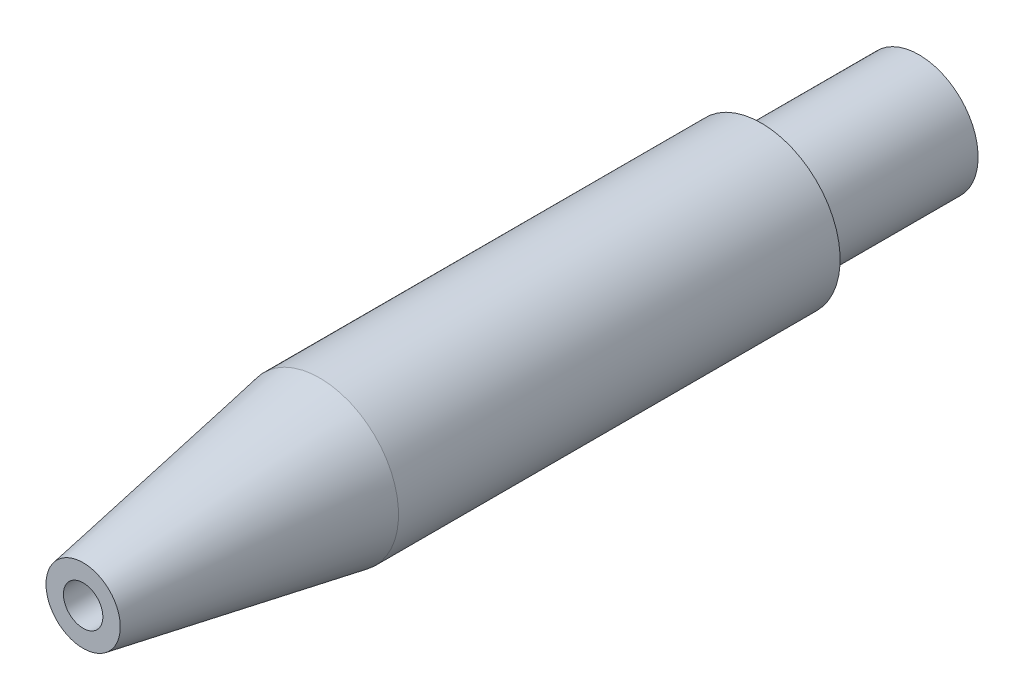
ISO-10303-21;
HEADER;
FILE_DESCRIPTION(('STEP AP214'),'2;1');
FILE_NAME('part.step','',(''),(''),'','','');
FILE_SCHEMA(('AUTOMOTIVE_DESIGN { 1 0 10303 214 1 1 1 1 }'));
ENDSEC;
DATA;
#1=APPLICATION_CONTEXT('core data for automotive mechanical design processes');
#2=APPLICATION_PROTOCOL_DEFINITION('international standard','automotive_design',2000,#1);
#3=PRODUCT_CONTEXT('',#1,'mechanical');
#4=PRODUCT('Part','Part','',(#3));
#5=PRODUCT_RELATED_PRODUCT_CATEGORY('part','',(#4));
#6=PRODUCT_DEFINITION_FORMATION('','',#4);
#7=PRODUCT_DEFINITION_CONTEXT('part definition',#1,'design');
#8=PRODUCT_DEFINITION('design','',#6,#7);
#9=PRODUCT_DEFINITION_SHAPE('','',#8);
#10=(LENGTH_UNIT() NAMED_UNIT(*) SI_UNIT(.MILLI.,.METRE.));
#11=(NAMED_UNIT(*) PLANE_ANGLE_UNIT() SI_UNIT($,.RADIAN.));
#12=(NAMED_UNIT(*) SI_UNIT($,.STERADIAN.) SOLID_ANGLE_UNIT());
#13=UNCERTAINTY_MEASURE_WITH_UNIT(LENGTH_MEASURE(1.E-05),#10,'distance_accuracy_value','');
#14=(GEOMETRIC_REPRESENTATION_CONTEXT(3) GLOBAL_UNCERTAINTY_ASSIGNED_CONTEXT((#13)) GLOBAL_UNIT_ASSIGNED_CONTEXT((#10,
#11,#12)) REPRESENTATION_CONTEXT('',''));
#15=CARTESIAN_POINT('',(0.,0.,0.));
#16=DIRECTION('',(0.,0.,1.));
#17=DIRECTION('',(1.,0.,0.));
#18=AXIS2_PLACEMENT_3D('',#15,#16,#17);
#19=CARTESIAN_POINT('',(0.,0.,67.31));
#20=DIRECTION('',(0.,0.,-1.));
#21=DIRECTION('',(-1.,0.,0.));
#22=AXIS2_PLACEMENT_3D('',#19,#20,#21);
#23=CYLINDRICAL_SURFACE('',#22,6.35);
#24=CARTESIAN_POINT('',(0.,0.,48.26));
#25=DIRECTION('',(0.,0.,-1.));
#26=DIRECTION('',(-1.,0.,0.));
#27=AXIS2_PLACEMENT_3D('',#24,#25,#26);
#28=CIRCLE('',#27,6.35);
#29=CARTESIAN_POINT('',(-6.35,0.,48.26));
#30=VERTEX_POINT('',#29);
#31=EDGE_CURVE('E56',#30,#30,#28,.T.);
#32=ORIENTED_EDGE('',*,*,#31,.T.);
#33=EDGE_LOOP('',(#32));
#34=FACE_BOUND('',#33,.T.);
#35=CARTESIAN_POINT('',(0.,0.,12.7));
#36=DIRECTION('',(0.,0.,-1.));
#37=DIRECTION('',(-1.,0.,0.));
#38=AXIS2_PLACEMENT_3D('',#35,#36,#37);
#39=CIRCLE('',#38,6.35);
#40=CARTESIAN_POINT('',(-6.35,0.,12.7));
#41=VERTEX_POINT('',#40);
#42=EDGE_CURVE('E65',#41,#41,#39,.T.);
#43=ORIENTED_EDGE('',*,*,#42,.F.);
#44=EDGE_LOOP('',(#43));
#45=FACE_BOUND('',#44,.T.);
#46=ADVANCED_FACE('F49',(#34,#45),#23,.T.);
#47=CARTESIAN_POINT('',(0.,0.,0.));
#48=DIRECTION('',(0.,0.,1.));
#49=DIRECTION('',(1.,0.,0.));
#50=AXIS2_PLACEMENT_3D('',#47,#48,#49);
#51=PLANE('',#50);
#52=CARTESIAN_POINT('',(0.,0.,0.));
#53=DIRECTION('',(0.,0.,-1.));
#54=DIRECTION('',(-1.,0.,0.));
#55=AXIS2_PLACEMENT_3D('',#52,#53,#54);
#56=CIRCLE('',#55,3.26389999999999);
#57=CARTESIAN_POINT('',(-3.26389999999999,0.,0.));
#58=VERTEX_POINT('',#57);
#59=EDGE_CURVE('E77',#58,#58,#56,.T.);
#60=ORIENTED_EDGE('',*,*,#59,.F.);
#61=EDGE_LOOP('',(#60));
#62=FACE_BOUND('',#61,.T.);
#63=CARTESIAN_POINT('',(0.,0.,0.));
#64=DIRECTION('',(0.,0.,-1.));
#65=DIRECTION('',(-1.,0.,0.));
#66=AXIS2_PLACEMENT_3D('',#63,#64,#65);
#67=CIRCLE('',#66,4.7625);
#68=CARTESIAN_POINT('',(-4.7625,0.,0.));
#69=VERTEX_POINT('',#68);
#70=EDGE_CURVE('E69',#69,#69,#67,.T.);
#71=ORIENTED_EDGE('',*,*,#70,.T.);
#72=EDGE_LOOP('',(#71));
#73=FACE_BOUND('',#72,.T.);
#74=ADVANCED_FACE('F83',(#62,#73),#51,.F.);
#75=CARTESIAN_POINT('',(0.,0.,48.26));
#76=DIRECTION('',(0.,0.,-1.));
#77=DIRECTION('',(-1.,0.,0.));
#78=AXIS2_PLACEMENT_3D('',#75,#76,#77);
#79=CONICAL_SURFACE('',#78,6.35,0.174532925199434);
#80=CARTESIAN_POINT('',(0.,0.,67.31));
#81=DIRECTION('',(0.,0.,-1.));
#82=DIRECTION('',(-1.,0.,0.));
#83=AXIS2_PLACEMENT_3D('',#80,#81,#82);
#84=CIRCLE('',#83,2.99097101750373);
#85=CARTESIAN_POINT('',(-2.99097101750373,0.,67.31));
#86=VERTEX_POINT('',#85);
#87=EDGE_CURVE('E12',#86,#86,#84,.T.);
#88=ORIENTED_EDGE('',*,*,#87,.T.);
#89=EDGE_LOOP('',(#88));
#90=FACE_BOUND('',#89,.T.);
#91=ORIENTED_EDGE('',*,*,#31,.F.);
#92=EDGE_LOOP('',(#91));
#93=FACE_BOUND('',#92,.T.);
#94=ADVANCED_FACE('F86',(#90,#93),#79,.T.);
#95=CARTESIAN_POINT('',(0.,0.,67.31));
#96=DIRECTION('',(0.,0.,1.));
#97=DIRECTION('',(1.,0.,0.));
#98=AXIS2_PLACEMENT_3D('',#95,#96,#97);
#99=PLANE('',#98);
#100=CARTESIAN_POINT('',(0.,0.,67.31));
#101=DIRECTION('',(0.,0.,1.));
#102=DIRECTION('',(1.,0.,0.));
#103=AXIS2_PLACEMENT_3D('',#100,#101,#102);
#104=CIRCLE('',#103,1.5875);
#105=CARTESIAN_POINT('',(1.5875,0.,67.31));
#106=VERTEX_POINT('',#105);
#107=EDGE_CURVE('E60',#106,#106,#104,.T.);
#108=ORIENTED_EDGE('',*,*,#107,.F.);
#109=EDGE_LOOP('',(#108));
#110=FACE_BOUND('',#109,.T.);
#111=ORIENTED_EDGE('',*,*,#87,.F.);
#112=EDGE_LOOP('',(#111));
#113=FACE_BOUND('',#112,.T.);
#114=ADVANCED_FACE('F114',(#110,#113),#99,.T.);
#115=CARTESIAN_POINT('',(0.,0.,0.));
#116=DIRECTION('',(0.,0.,1.));
#117=DIRECTION('',(1.,0.,0.));
#118=AXIS2_PLACEMENT_3D('',#115,#116,#117);
#119=CYLINDRICAL_SURFACE('',#118,1.5875);
#120=CARTESIAN_POINT('',(0.,0.,60.6972827417378));
#121=DIRECTION('',(0.,0.,-1.));
#122=DIRECTION('',(-1.,0.,0.));
#123=AXIS2_PLACEMENT_3D('',#120,#121,#122);
#124=CIRCLE('',#123,1.5875);
#125=CARTESIAN_POINT('',(-1.5875,0.,60.6972827417378));
#126=VERTEX_POINT('',#125);
#127=EDGE_CURVE('E52',#126,#126,#124,.T.);
#128=ORIENTED_EDGE('',*,*,#127,.T.);
#129=EDGE_LOOP('',(#128));
#130=FACE_BOUND('',#129,.T.);
#131=ORIENTED_EDGE('',*,*,#107,.T.);
#132=EDGE_LOOP('',(#131));
#133=FACE_BOUND('',#132,.T.);
#134=ADVANCED_FACE('F101',(#130,#133),#119,.F.);
#135=CARTESIAN_POINT('',(0.,0.,12.7));
#136=DIRECTION('',(0.,0.,-1.));
#137=DIRECTION('',(-1.,0.,0.));
#138=AXIS2_PLACEMENT_3D('',#135,#136,#137);
#139=PLANE('',#138);
#140=CARTESIAN_POINT('',(0.,0.,12.7));
#141=DIRECTION('',(0.,0.,-1.));
#142=DIRECTION('',(-1.,0.,0.));
#143=AXIS2_PLACEMENT_3D('',#140,#141,#142);
#144=CIRCLE('',#143,4.7625);
#145=CARTESIAN_POINT('',(-4.7625,0.,12.7));
#146=VERTEX_POINT('',#145);
#147=EDGE_CURVE('E68',#146,#146,#144,.T.);
#148=ORIENTED_EDGE('',*,*,#147,.F.);
#149=EDGE_LOOP('',(#148));
#150=FACE_BOUND('',#149,.T.);
#151=ORIENTED_EDGE('',*,*,#42,.T.);
#152=EDGE_LOOP('',(#151));
#153=FACE_BOUND('',#152,.T.);
#154=ADVANCED_FACE('F92',(#150,#153),#139,.T.);
#155=CARTESIAN_POINT('',(0.,0.,12.7));
#156=DIRECTION('',(0.,0.,-1.));
#157=DIRECTION('',(-1.,0.,0.));
#158=AXIS2_PLACEMENT_3D('',#155,#156,#157);
#159=CYLINDRICAL_SURFACE('',#158,4.7625);
#160=ORIENTED_EDGE('',*,*,#147,.T.);
#161=EDGE_LOOP('',(#160));
#162=FACE_BOUND('',#161,.T.);
#163=ORIENTED_EDGE('',*,*,#70,.F.);
#164=EDGE_LOOP('',(#163));
#165=FACE_BOUND('',#164,.T.);
#166=ADVANCED_FACE('F89',(#162,#165),#159,.T.);
#167=CARTESIAN_POINT('',(0.,0.,59.69));
#168=DIRECTION('',(0.,0.,-1.));
#169=DIRECTION('',(-1.,0.,0.));
#170=AXIS2_PLACEMENT_3D('',#167,#168,#169);
#171=CONICAL_SURFACE('',#170,3.26389999999999,1.02974425867665);
#172=CARTESIAN_POINT('',(0.,0.,59.69));
#173=DIRECTION('',(0.,0.,-1.));
#174=DIRECTION('',(-1.,0.,0.));
#175=AXIS2_PLACEMENT_3D('',#172,#173,#174);
#176=CIRCLE('',#175,3.26389999999999);
#177=CARTESIAN_POINT('',(-3.26389999999999,0.,59.69));
#178=VERTEX_POINT('',#177);
#179=EDGE_CURVE('E74',#178,#178,#176,.T.);
#180=ORIENTED_EDGE('',*,*,#179,.T.);
#181=EDGE_LOOP('',(#180));
#182=FACE_BOUND('',#181,.T.);
#183=ORIENTED_EDGE('',*,*,#127,.F.);
#184=EDGE_LOOP('',(#183));
#185=FACE_BOUND('',#184,.T.);
#186=ADVANCED_FACE('F91',(#182,#185),#171,.F.);
#187=CARTESIAN_POINT('',(0.,0.,0.));
#188=DIRECTION('',(0.,0.,-1.));
#189=DIRECTION('',(-1.,0.,0.));
#190=AXIS2_PLACEMENT_3D('',#187,#188,#189);
#191=CYLINDRICAL_SURFACE('',#190,3.26389999999999);
#192=ORIENTED_EDGE('',*,*,#179,.F.);
#193=EDGE_LOOP('',(#192));
#194=FACE_BOUND('',#193,.T.);
#195=ORIENTED_EDGE('',*,*,#59,.T.);
#196=EDGE_LOOP('',(#195));
#197=FACE_BOUND('',#196,.T.);
#198=ADVANCED_FACE('F81',(#194,#197),#191,.F.);
#199=CLOSED_SHELL('',(#46,#74,#94,#114,#134,#154,#166,#186,#198));
#200=MANIFOLD_SOLID_BREP('B2',#199);
#201=ADVANCED_BREP_SHAPE_REPRESENTATION('',(#18,#200),#14);
#202=SHAPE_DEFINITION_REPRESENTATION(#9,#201);
ENDSEC;
END-ISO-10303-21;
